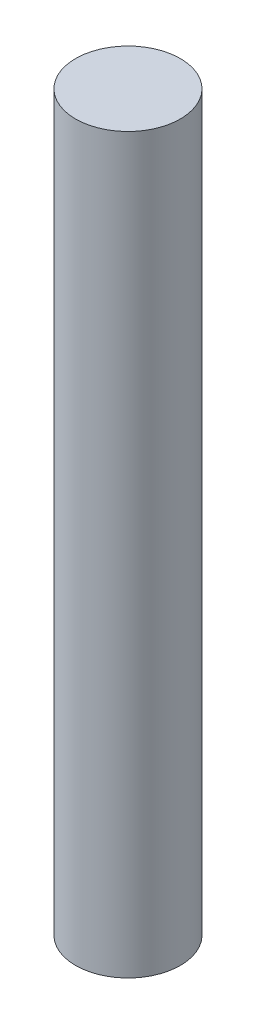
ISO-10303-21;
HEADER;
FILE_DESCRIPTION(('STEP AP214'),'2;1');
FILE_NAME('part.step','',(''),(''),'','','');
FILE_SCHEMA(('AUTOMOTIVE_DESIGN { 1 0 10303 214 1 1 1 1 }'));
ENDSEC;
DATA;
#1=APPLICATION_CONTEXT('core data for automotive mechanical design processes');
#2=APPLICATION_PROTOCOL_DEFINITION('international standard','automotive_design',2000,#1);
#3=PRODUCT_CONTEXT('',#1,'mechanical');
#4=PRODUCT('Part','Part','',(#3));
#5=PRODUCT_RELATED_PRODUCT_CATEGORY('part','',(#4));
#6=PRODUCT_DEFINITION_FORMATION('','',#4);
#7=PRODUCT_DEFINITION_CONTEXT('part definition',#1,'design');
#8=PRODUCT_DEFINITION('design','',#6,#7);
#9=PRODUCT_DEFINITION_SHAPE('','',#8);
#10=(LENGTH_UNIT() NAMED_UNIT(*) SI_UNIT(.MILLI.,.METRE.));
#11=(NAMED_UNIT(*) PLANE_ANGLE_UNIT() SI_UNIT($,.RADIAN.));
#12=(NAMED_UNIT(*) SI_UNIT($,.STERADIAN.) SOLID_ANGLE_UNIT());
#13=UNCERTAINTY_MEASURE_WITH_UNIT(LENGTH_MEASURE(1.E-05),#10,'distance_accuracy_value','');
#14=(GEOMETRIC_REPRESENTATION_CONTEXT(3) GLOBAL_UNCERTAINTY_ASSIGNED_CONTEXT((#13)) GLOBAL_UNIT_ASSIGNED_CONTEXT((#10,
#11,#12)) REPRESENTATION_CONTEXT('',''));
#15=CARTESIAN_POINT('',(0.,0.,0.));
#16=DIRECTION('',(0.,0.,1.));
#17=DIRECTION('',(1.,0.,0.));
#18=AXIS2_PLACEMENT_3D('',#15,#16,#17);
#19=CARTESIAN_POINT('',(0.,177.8,0.));
#20=DIRECTION('',(0.,-1.,0.));
#21=DIRECTION('',(0.,0.,-1.));
#22=AXIS2_PLACEMENT_3D('',#19,#20,#21);
#23=CYLINDRICAL_SURFACE('',#22,12.7);
#24=CARTESIAN_POINT('',(0.,177.8,0.));
#25=DIRECTION('',(0.,1.,0.));
#26=DIRECTION('',(0.,0.,1.));
#27=AXIS2_PLACEMENT_3D('',#24,#25,#26);
#28=CIRCLE('',#27,12.7);
#29=CARTESIAN_POINT('',(0.,177.8,12.7));
#30=VERTEX_POINT('',#29);
#31=EDGE_CURVE('E10',#30,#30,#28,.T.);
#32=ORIENTED_EDGE('',*,*,#31,.F.);
#33=EDGE_LOOP('',(#32));
#34=FACE_BOUND('',#33,.T.);
#35=CARTESIAN_POINT('',(0.,0.,0.));
#36=DIRECTION('',(0.,1.,0.));
#37=DIRECTION('',(0.,0.,1.));
#38=AXIS2_PLACEMENT_3D('',#35,#36,#37);
#39=CIRCLE('',#38,12.7);
#40=CARTESIAN_POINT('',(0.,0.,12.7));
#41=VERTEX_POINT('',#40);
#42=EDGE_CURVE('E35',#41,#41,#39,.T.);
#43=ORIENTED_EDGE('',*,*,#42,.T.);
#44=EDGE_LOOP('',(#43));
#45=FACE_BOUND('',#44,.T.);
#46=ADVANCED_FACE('F32',(#34,#45),#23,.T.);
#47=CARTESIAN_POINT('',(0.,177.8,0.));
#48=DIRECTION('',(0.,1.,0.));
#49=DIRECTION('',(0.,0.,1.));
#50=AXIS2_PLACEMENT_3D('',#47,#48,#49);
#51=PLANE('',#50);
#52=ORIENTED_EDGE('',*,*,#31,.T.);
#53=EDGE_LOOP('',(#52));
#54=FACE_BOUND('',#53,.T.);
#55=ADVANCED_FACE('F47',(#54),#51,.T.);
#56=CARTESIAN_POINT('',(0.,0.,0.));
#57=DIRECTION('',(0.,1.,0.));
#58=DIRECTION('',(0.,0.,1.));
#59=AXIS2_PLACEMENT_3D('',#56,#57,#58);
#60=PLANE('',#59);
#61=ORIENTED_EDGE('',*,*,#42,.F.);
#62=EDGE_LOOP('',(#61));
#63=FACE_BOUND('',#62,.T.);
#64=ADVANCED_FACE('F45',(#63),#60,.F.);
#65=CLOSED_SHELL('',(#46,#55,#64));
#66=MANIFOLD_SOLID_BREP('B2',#65);
#67=ADVANCED_BREP_SHAPE_REPRESENTATION('',(#18,#66),#14);
#68=SHAPE_DEFINITION_REPRESENTATION(#9,#67);
ENDSEC;
END-ISO-10303-21;
